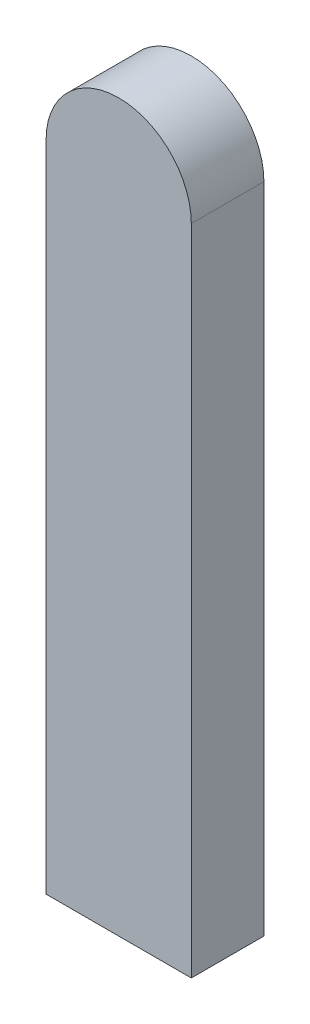
ISO-10303-21;
HEADER;
FILE_DESCRIPTION(('STEP AP214'),'2;1');
FILE_NAME('part.step','',(''),(''),'','','');
FILE_SCHEMA(('AUTOMOTIVE_DESIGN { 1 0 10303 214 1 1 1 1 }'));
ENDSEC;
DATA;
#1=APPLICATION_CONTEXT('core data for automotive mechanical design processes');
#2=APPLICATION_PROTOCOL_DEFINITION('international standard','automotive_design',2000,#1);
#3=PRODUCT_CONTEXT('',#1,'mechanical');
#4=PRODUCT('Part','Part','',(#3));
#5=PRODUCT_RELATED_PRODUCT_CATEGORY('part','',(#4));
#6=PRODUCT_DEFINITION_FORMATION('','',#4);
#7=PRODUCT_DEFINITION_CONTEXT('part definition',#1,'design');
#8=PRODUCT_DEFINITION('design','',#6,#7);
#9=PRODUCT_DEFINITION_SHAPE('','',#8);
#10=(LENGTH_UNIT() NAMED_UNIT(*) SI_UNIT(.MILLI.,.METRE.));
#11=(NAMED_UNIT(*) PLANE_ANGLE_UNIT() SI_UNIT($,.RADIAN.));
#12=(NAMED_UNIT(*) SI_UNIT($,.STERADIAN.) SOLID_ANGLE_UNIT());
#13=UNCERTAINTY_MEASURE_WITH_UNIT(LENGTH_MEASURE(1.E-05),#10,'distance_accuracy_value','');
#14=(GEOMETRIC_REPRESENTATION_CONTEXT(3) GLOBAL_UNCERTAINTY_ASSIGNED_CONTEXT((#13)) GLOBAL_UNIT_ASSIGNED_CONTEXT((#10,
#11,#12)) REPRESENTATION_CONTEXT('',''));
#15=CARTESIAN_POINT('',(0.,0.,0.));
#16=DIRECTION('',(0.,0.,1.));
#17=DIRECTION('',(1.,0.,0.));
#18=AXIS2_PLACEMENT_3D('',#15,#16,#17);
#19=CARTESIAN_POINT('',(9.99999999999999,45.,10.));
#20=DIRECTION('',(-1.,0.,0.));
#21=DIRECTION('',(0.,-1.,0.));
#22=AXIS2_PLACEMENT_3D('',#19,#20,#21);
#23=PLANE('',#22);
#24=DIRECTION('',(0.,1.,0.));
#25=VECTOR('',#24,1.);
#26=CARTESIAN_POINT('',(9.99999999999999,45.,0.));
#27=LINE('',#26,#25);
#28=CARTESIAN_POINT('',(10.,-45.,0.));
#29=VERTEX_POINT('',#28);
#30=CARTESIAN_POINT('',(9.99999999999999,45.,0.));
#31=VERTEX_POINT('',#30);
#32=EDGE_CURVE('E96',#29,#31,#27,.T.);
#33=ORIENTED_EDGE('',*,*,#32,.T.);
#34=DIRECTION('',(0.,0.,-1.));
#35=VECTOR('',#34,1.);
#36=CARTESIAN_POINT('',(9.99999999999999,45.,10.));
#37=LINE('',#36,#35);
#38=CARTESIAN_POINT('',(9.99999999999999,45.,10.));
#39=VERTEX_POINT('',#38);
#40=EDGE_CURVE('E11',#39,#31,#37,.T.);
#41=ORIENTED_EDGE('',*,*,#40,.F.);
#42=DIRECTION('',(0.,1.,0.));
#43=VECTOR('',#42,1.);
#44=CARTESIAN_POINT('',(9.99999999999999,45.,10.));
#45=LINE('',#44,#43);
#46=CARTESIAN_POINT('',(10.,-45.,10.));
#47=VERTEX_POINT('',#46);
#48=EDGE_CURVE('E84',#47,#39,#45,.T.);
#49=ORIENTED_EDGE('',*,*,#48,.F.);
#50=DIRECTION('',(0.,0.,-1.));
#51=VECTOR('',#50,1.);
#52=CARTESIAN_POINT('',(10.,-45.,10.));
#53=LINE('',#52,#51);
#54=EDGE_CURVE('E92',#47,#29,#53,.T.);
#55=ORIENTED_EDGE('',*,*,#54,.T.);
#56=EDGE_LOOP('',(#33,#41,#49,#55));
#57=FACE_BOUND('',#56,.T.);
#58=ADVANCED_FACE('F33',(#57),#23,.F.);
#59=CARTESIAN_POINT('',(0.,45.,10.));
#60=DIRECTION('',(0.,0.,-1.));
#61=DIRECTION('',(-1.,0.,0.));
#62=AXIS2_PLACEMENT_3D('',#59,#60,#61);
#63=CYLINDRICAL_SURFACE('',#62,10.);
#64=CARTESIAN_POINT('',(0.,45.,0.));
#65=DIRECTION('',(0.,0.,1.));
#66=DIRECTION('',(1.,0.,0.));
#67=AXIS2_PLACEMENT_3D('',#64,#65,#66);
#68=CIRCLE('',#67,10.);
#69=CARTESIAN_POINT('',(-10.,45.,0.));
#70=VERTEX_POINT('',#69);
#71=EDGE_CURVE('E88',#31,#70,#68,.T.);
#72=ORIENTED_EDGE('',*,*,#71,.T.);
#73=DIRECTION('',(0.,0.,-1.));
#74=VECTOR('',#73,1.);
#75=CARTESIAN_POINT('',(-10.,45.,10.));
#76=LINE('',#75,#74);
#77=CARTESIAN_POINT('',(-10.,45.,10.));
#78=VERTEX_POINT('',#77);
#79=EDGE_CURVE('E41',#78,#70,#76,.T.);
#80=ORIENTED_EDGE('',*,*,#79,.F.);
#81=CARTESIAN_POINT('',(0.,45.,10.));
#82=DIRECTION('',(0.,0.,1.));
#83=DIRECTION('',(1.,0.,0.));
#84=AXIS2_PLACEMENT_3D('',#81,#82,#83);
#85=CIRCLE('',#84,10.);
#86=EDGE_CURVE('E79',#39,#78,#85,.T.);
#87=ORIENTED_EDGE('',*,*,#86,.F.);
#88=ORIENTED_EDGE('',*,*,#40,.T.);
#89=EDGE_LOOP('',(#72,#80,#87,#88));
#90=FACE_BOUND('',#89,.T.);
#91=ADVANCED_FACE('F87',(#90),#63,.T.);
#92=CARTESIAN_POINT('',(-10.,45.,10.));
#93=DIRECTION('',(1.,0.,0.));
#94=DIRECTION('',(0.,1.,0.));
#95=AXIS2_PLACEMENT_3D('',#92,#93,#94);
#96=PLANE('',#95);
#97=DIRECTION('',(0.,-1.,0.));
#98=VECTOR('',#97,1.);
#99=CARTESIAN_POINT('',(-10.,45.,0.));
#100=LINE('',#99,#98);
#101=CARTESIAN_POINT('',(-9.99999999999999,-45.,0.));
#102=VERTEX_POINT('',#101);
#103=EDGE_CURVE('E66',#70,#102,#100,.T.);
#104=ORIENTED_EDGE('',*,*,#103,.T.);
#105=DIRECTION('',(0.,0.,-1.));
#106=VECTOR('',#105,1.);
#107=CARTESIAN_POINT('',(-9.99999999999999,-45.,10.));
#108=LINE('',#107,#106);
#109=CARTESIAN_POINT('',(-9.99999999999999,-45.,10.));
#110=VERTEX_POINT('',#109);
#111=EDGE_CURVE('E89',#110,#102,#108,.T.);
#112=ORIENTED_EDGE('',*,*,#111,.F.);
#113=DIRECTION('',(0.,-1.,0.));
#114=VECTOR('',#113,1.);
#115=CARTESIAN_POINT('',(-10.,45.,10.));
#116=LINE('',#115,#114);
#117=EDGE_CURVE('E82',#78,#110,#116,.T.);
#118=ORIENTED_EDGE('',*,*,#117,.F.);
#119=ORIENTED_EDGE('',*,*,#79,.T.);
#120=EDGE_LOOP('',(#104,#112,#118,#119));
#121=FACE_BOUND('',#120,.T.);
#122=ADVANCED_FACE('F90',(#121),#96,.F.);
#123=CARTESIAN_POINT('',(-9.99999999999999,-45.,10.));
#124=DIRECTION('',(0.,1.,0.));
#125=DIRECTION('',(0.,0.,1.));
#126=AXIS2_PLACEMENT_3D('',#123,#124,#125);
#127=PLANE('',#126);
#128=DIRECTION('',(1.,0.,0.));
#129=VECTOR('',#128,1.);
#130=CARTESIAN_POINT('',(-9.99999999999999,-45.,0.));
#131=LINE('',#130,#129);
#132=EDGE_CURVE('E72',#102,#29,#131,.T.);
#133=ORIENTED_EDGE('',*,*,#132,.T.);
#134=ORIENTED_EDGE('',*,*,#54,.F.);
#135=DIRECTION('',(1.,0.,0.));
#136=VECTOR('',#135,1.);
#137=CARTESIAN_POINT('',(-9.99999999999999,-45.,10.));
#138=LINE('',#137,#136);
#139=EDGE_CURVE('E49',#110,#47,#138,.T.);
#140=ORIENTED_EDGE('',*,*,#139,.F.);
#141=ORIENTED_EDGE('',*,*,#111,.T.);
#142=EDGE_LOOP('',(#133,#134,#140,#141));
#143=FACE_BOUND('',#142,.T.);
#144=ADVANCED_FACE('F103',(#143),#127,.F.);
#145=CARTESIAN_POINT('',(0.,45.,10.));
#146=DIRECTION('',(0.,0.,1.));
#147=DIRECTION('',(1.,0.,0.));
#148=AXIS2_PLACEMENT_3D('',#145,#146,#147);
#149=PLANE('',#148);
#150=ORIENTED_EDGE('',*,*,#48,.T.);
#151=ORIENTED_EDGE('',*,*,#86,.T.);
#152=ORIENTED_EDGE('',*,*,#117,.T.);
#153=ORIENTED_EDGE('',*,*,#139,.T.);
#154=EDGE_LOOP('',(#150,#151,#152,#153));
#155=FACE_BOUND('',#154,.T.);
#156=ADVANCED_FACE('F80',(#155),#149,.T.);
#157=CARTESIAN_POINT('',(0.,45.,0.));
#158=DIRECTION('',(0.,0.,1.));
#159=DIRECTION('',(1.,0.,0.));
#160=AXIS2_PLACEMENT_3D('',#157,#158,#159);
#161=PLANE('',#160);
#162=ORIENTED_EDGE('',*,*,#32,.F.);
#163=ORIENTED_EDGE('',*,*,#132,.F.);
#164=ORIENTED_EDGE('',*,*,#103,.F.);
#165=ORIENTED_EDGE('',*,*,#71,.F.);
#166=EDGE_LOOP('',(#162,#163,#164,#165));
#167=FACE_BOUND('',#166,.T.);
#168=ADVANCED_FACE('F106',(#167),#161,.F.);
#169=CLOSED_SHELL('',(#58,#91,#122,#144,#156,#168));
#170=MANIFOLD_SOLID_BREP('B2',#169);
#171=ADVANCED_BREP_SHAPE_REPRESENTATION('',(#18,#170),#14);
#172=SHAPE_DEFINITION_REPRESENTATION(#9,#171);
ENDSEC;
END-ISO-10303-21;
